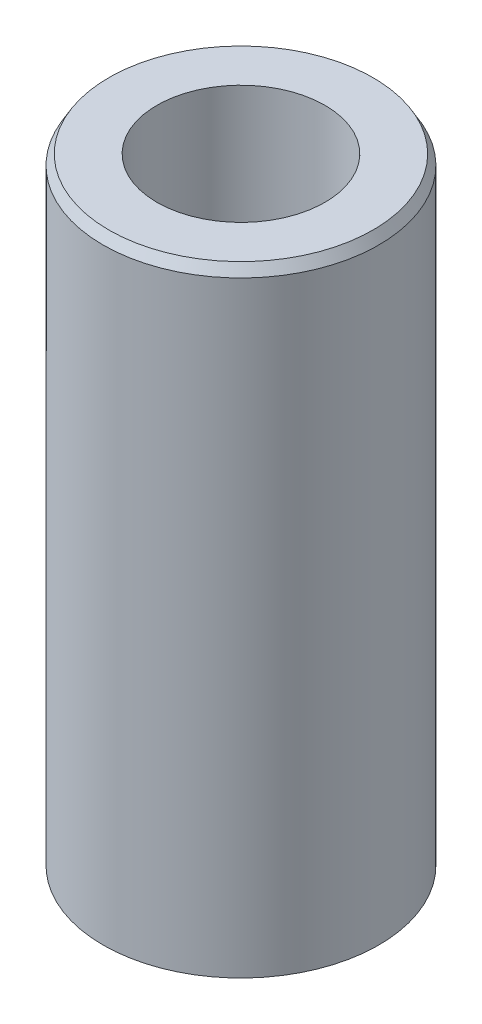
ISO-10303-21;
HEADER;
FILE_DESCRIPTION(('STEP AP214'),'2;1');
FILE_NAME('part.step','',(''),(''),'','','');
FILE_SCHEMA(('AUTOMOTIVE_DESIGN { 1 0 10303 214 1 1 1 1 }'));
ENDSEC;
DATA;
#1=APPLICATION_CONTEXT('core data for automotive mechanical design processes');
#2=APPLICATION_PROTOCOL_DEFINITION('international standard','automotive_design',2000,#1);
#3=PRODUCT_CONTEXT('',#1,'mechanical');
#4=PRODUCT('Part','Part','',(#3));
#5=PRODUCT_RELATED_PRODUCT_CATEGORY('part','',(#4));
#6=PRODUCT_DEFINITION_FORMATION('','',#4);
#7=PRODUCT_DEFINITION_CONTEXT('part definition',#1,'design');
#8=PRODUCT_DEFINITION('design','',#6,#7);
#9=PRODUCT_DEFINITION_SHAPE('','',#8);
#10=(LENGTH_UNIT() NAMED_UNIT(*) SI_UNIT(.MILLI.,.METRE.));
#11=(NAMED_UNIT(*) PLANE_ANGLE_UNIT() SI_UNIT($,.RADIAN.));
#12=(NAMED_UNIT(*) SI_UNIT($,.STERADIAN.) SOLID_ANGLE_UNIT());
#13=UNCERTAINTY_MEASURE_WITH_UNIT(LENGTH_MEASURE(1.E-05),#10,'distance_accuracy_value','');
#14=(GEOMETRIC_REPRESENTATION_CONTEXT(3) GLOBAL_UNCERTAINTY_ASSIGNED_CONTEXT((#13)) GLOBAL_UNIT_ASSIGNED_CONTEXT((#10,
#11,#12)) REPRESENTATION_CONTEXT('',''));
#15=CARTESIAN_POINT('',(0.,0.,0.));
#16=DIRECTION('',(0.,0.,1.));
#17=DIRECTION('',(1.,0.,0.));
#18=AXIS2_PLACEMENT_3D('',#15,#16,#17);
#19=CARTESIAN_POINT('',(0.,259.494421782768,0.));
#20=DIRECTION('',(0.,-1.,0.));
#21=DIRECTION('',(0.,0.,-1.));
#22=AXIS2_PLACEMENT_3D('',#19,#20,#21);
#23=CYLINDRICAL_SURFACE('',#22,57.5);
#24=CARTESIAN_POINT('',(0.,255.298079394231,0.));
#25=DIRECTION('',(0.,1.,0.));
#26=DIRECTION('',(0.,0.,1.));
#27=AXIS2_PLACEMENT_3D('',#24,#25,#26);
#28=CIRCLE('',#27,57.5);
#29=CARTESIAN_POINT('',(0.,255.298079394231,57.5));
#30=VERTEX_POINT('',#29);
#31=EDGE_CURVE('E50',#30,#30,#28,.F.);
#32=ORIENTED_EDGE('',*,*,#31,.T.);
#33=EDGE_LOOP('',(#32));
#34=FACE_BOUND('',#33,.T.);
#35=CARTESIAN_POINT('',(0.,2.42275940763359,0.));
#36=DIRECTION('',(0.,1.,0.));
#37=DIRECTION('',(0.,0.,1.));
#38=AXIS2_PLACEMENT_3D('',#35,#36,#37);
#39=CIRCLE('',#38,57.5);
#40=CARTESIAN_POINT('',(0.,2.42275940763359,57.5));
#41=VERTEX_POINT('',#40);
#42=EDGE_CURVE('E51',#41,#41,#39,.T.);
#43=ORIENTED_EDGE('',*,*,#42,.T.);
#44=EDGE_LOOP('',(#43));
#45=FACE_BOUND('',#44,.T.);
#46=ADVANCED_FACE('F39',(#34,#45),#23,.T.);
#47=CARTESIAN_POINT('',(0.,259.494421782768,0.));
#48=DIRECTION('',(0.,1.,0.));
#49=DIRECTION('',(0.,0.,1.));
#50=AXIS2_PLACEMENT_3D('',#47,#48,#49);
#51=PLANE('',#50);
#52=CARTESIAN_POINT('',(0.,259.494421782768,0.));
#53=DIRECTION('',(0.,1.,0.));
#54=DIRECTION('',(0.,0.,1.));
#55=AXIS2_PLACEMENT_3D('',#52,#53,#54);
#56=CIRCLE('',#55,55.0772405923664);
#57=CARTESIAN_POINT('',(0.,259.494421782768,55.0772405923664));
#58=VERTEX_POINT('',#57);
#59=EDGE_CURVE('E54',#58,#58,#56,.T.);
#60=ORIENTED_EDGE('',*,*,#59,.T.);
#61=EDGE_LOOP('',(#60));
#62=FACE_BOUND('',#61,.T.);
#63=CARTESIAN_POINT('',(0.,259.494421782768,0.));
#64=DIRECTION('',(0.,1.,0.));
#65=DIRECTION('',(0.,0.,1.));
#66=AXIS2_PLACEMENT_3D('',#63,#64,#65);
#67=CIRCLE('',#66,35.0617956177539);
#68=CARTESIAN_POINT('',(0.,259.494421782768,35.0617956177539));
#69=VERTEX_POINT('',#68);
#70=EDGE_CURVE('E58',#69,#69,#67,.T.);
#71=ORIENTED_EDGE('',*,*,#70,.F.);
#72=EDGE_LOOP('',(#71));
#73=FACE_BOUND('',#72,.T.);
#74=ADVANCED_FACE('F69',(#62,#73),#51,.T.);
#75=CARTESIAN_POINT('',(0.,0.,0.));
#76=DIRECTION('',(0.,1.,0.));
#77=DIRECTION('',(0.,0.,1.));
#78=AXIS2_PLACEMENT_3D('',#75,#76,#77);
#79=PLANE('',#78);
#80=CARTESIAN_POINT('',(0.,0.,0.));
#81=DIRECTION('',(0.,1.,0.));
#82=DIRECTION('',(0.,0.,1.));
#83=AXIS2_PLACEMENT_3D('',#80,#81,#82);
#84=CIRCLE('',#83,53.3036576114631);
#85=CARTESIAN_POINT('',(0.,0.,53.3036576114631));
#86=VERTEX_POINT('',#85);
#87=EDGE_CURVE('E10',#86,#86,#84,.F.);
#88=ORIENTED_EDGE('',*,*,#87,.T.);
#89=EDGE_LOOP('',(#88));
#90=FACE_BOUND('',#89,.T.);
#91=CARTESIAN_POINT('',(0.,0.,0.));
#92=DIRECTION('',(0.,1.,0.));
#93=DIRECTION('',(0.,0.,1.));
#94=AXIS2_PLACEMENT_3D('',#91,#92,#93);
#95=CIRCLE('',#94,35.0617956177539);
#96=CARTESIAN_POINT('',(0.,0.,35.0617956177539));
#97=VERTEX_POINT('',#96);
#98=EDGE_CURVE('E63',#97,#97,#95,.T.);
#99=ORIENTED_EDGE('',*,*,#98,.T.);
#100=EDGE_LOOP('',(#99));
#101=FACE_BOUND('',#100,.T.);
#102=ADVANCED_FACE('F75',(#90,#101),#79,.F.);
#103=CARTESIAN_POINT('',(0.,259.494421782768,0.));
#104=DIRECTION('',(0.,-1.,0.));
#105=DIRECTION('',(0.,0.,-1.));
#106=AXIS2_PLACEMENT_3D('',#103,#104,#105);
#107=CYLINDRICAL_SURFACE('',#106,35.0617956177539);
#108=ORIENTED_EDGE('',*,*,#70,.T.);
#109=EDGE_LOOP('',(#108));
#110=FACE_BOUND('',#109,.T.);
#111=ORIENTED_EDGE('',*,*,#98,.F.);
#112=EDGE_LOOP('',(#111));
#113=FACE_BOUND('',#112,.T.);
#114=ADVANCED_FACE('F70',(#110,#113),#107,.F.);
#115=CARTESIAN_POINT('',(0.,259.494421782768,0.));
#116=DIRECTION('',(0.,-1.,0.));
#117=DIRECTION('',(0.,0.,-1.));
#118=AXIS2_PLACEMENT_3D('',#115,#116,#117);
#119=CONICAL_SURFACE('',#118,55.0772405923664,0.523598775598296);
#120=ORIENTED_EDGE('',*,*,#31,.F.);
#121=EDGE_LOOP('',(#120));
#122=FACE_BOUND('',#121,.T.);
#123=ORIENTED_EDGE('',*,*,#59,.F.);
#124=EDGE_LOOP('',(#123));
#125=FACE_BOUND('',#124,.T.);
#126=ADVANCED_FACE('F81',(#122,#125),#119,.T.);
#127=CARTESIAN_POINT('',(0.,2.42275940763359,0.));
#128=DIRECTION('',(0.,1.,0.));
#129=DIRECTION('',(0.,0.,1.));
#130=AXIS2_PLACEMENT_3D('',#127,#128,#129);
#131=CONICAL_SURFACE('',#130,57.5,1.04719755119661);
#132=CARTESIAN_POINT('',(0.,0.,53.3036576114631));
#133=CARTESIAN_POINT('',(0.,0.0252370771628502,53.3473695113437));
#134=CARTESIAN_POINT('',(0.,0.0504741543256997,53.3910814112243));
#135=CARTESIAN_POINT('',(0.,0.100948308651399,53.4785052109854));
#136=CARTESIAN_POINT('',(0.,0.126185385814248,53.522217110866));
#137=CARTESIAN_POINT('',(0.,0.176659540139949,53.6096409106272));
#138=CARTESIAN_POINT('',(0.,0.201896617302799,53.6533528105078));
#139=CARTESIAN_POINT('',(0.,0.252370771628499,53.740776610269));
#140=CARTESIAN_POINT('',(0.,0.277607848791349,53.7844885101496));
#141=CARTESIAN_POINT('',(0.,0.328082003117048,53.8719123099108));
#142=CARTESIAN_POINT('',(0.,0.353319080279898,53.9156242097914));
#143=CARTESIAN_POINT('',(0.,0.403793234605598,54.0030480095526));
#144=CARTESIAN_POINT('',(0.,0.429030311768448,54.0467599094331));
#145=CARTESIAN_POINT('',(0.,0.479504466094148,54.1341837091943));
#146=CARTESIAN_POINT('',(0.,0.504741543256997,54.1778956090749));
#147=CARTESIAN_POINT('',(0.,0.555215697582697,54.2653194088361));
#148=CARTESIAN_POINT('',(0.,0.580452774745547,54.3090313087167));
#149=CARTESIAN_POINT('',(0.,0.630926929071247,54.3964551084779));
#150=CARTESIAN_POINT('',(0.,0.656164006234097,54.4401670083585));
#151=CARTESIAN_POINT('',(0.,0.706638160559796,54.5275908081197));
#152=CARTESIAN_POINT('',(0.,0.731875237722646,54.5713027080003));
#153=CARTESIAN_POINT('',(0.,0.782349392048346,54.6587265077615));
#154=CARTESIAN_POINT('',(0.,0.807586469211196,54.702438407642));
#155=CARTESIAN_POINT('',(0.,0.858060623536896,54.7898622074032));
#156=CARTESIAN_POINT('',(0.,0.883297700699746,54.8335741072838));
#157=CARTESIAN_POINT('',(0.,0.933771855025446,54.920997907045));
#158=CARTESIAN_POINT('',(0.,0.959008932188296,54.9647098069256));
#159=CARTESIAN_POINT('',(0.,1.009483086514,55.0521336066868));
#160=CARTESIAN_POINT('',(0.,1.03472016367685,55.0958455065674));
#161=CARTESIAN_POINT('',(0.,1.08519431800255,55.1832693063286));
#162=CARTESIAN_POINT('',(0.,1.1104313951654,55.2269812062092));
#163=CARTESIAN_POINT('',(0.,1.16090554949109,55.3144050059704));
#164=CARTESIAN_POINT('',(0.,1.18614262665394,55.3581169058509));
#165=CARTESIAN_POINT('',(0.,1.23661678097964,55.4455407056121));
#166=CARTESIAN_POINT('',(0.,1.26185385814249,55.4892526054927));
#167=CARTESIAN_POINT('',(0.,1.31232801246819,55.5766764052539));
#168=CARTESIAN_POINT('',(0.,1.33756508963104,55.6203883051345));
#169=CARTESIAN_POINT('',(0.,1.38803924395674,55.7078121048957));
#170=CARTESIAN_POINT('',(0.,1.41327632111959,55.7515240047763));
#171=CARTESIAN_POINT('',(0.,1.46375047544529,55.8389478045375));
#172=CARTESIAN_POINT('',(0.,1.48898755260814,55.8826597044181));
#173=CARTESIAN_POINT('',(0.,1.53946170693384,55.9700835041793));
#174=CARTESIAN_POINT('',(0.,1.56469878409669,56.0137954040598));
#175=CARTESIAN_POINT('',(0.,1.61517293842239,56.101219203821));
#176=CARTESIAN_POINT('',(0.,1.64041001558524,56.1449311037016));
#177=CARTESIAN_POINT('',(0.,1.69088416991094,56.2323549034628));
#178=CARTESIAN_POINT('',(0.,1.71612124707379,56.2760668033434));
#179=CARTESIAN_POINT('',(0.,1.76659540139949,56.3634906031046));
#180=CARTESIAN_POINT('',(0.,1.79183247856234,56.4072025029852));
#181=CARTESIAN_POINT('',(0.,1.84230663288804,56.4946263027464));
#182=CARTESIAN_POINT('',(0.,1.86754371005089,56.538338202627));
#183=CARTESIAN_POINT('',(0.,1.91801786437659,56.6257620023881));
#184=CARTESIAN_POINT('',(0.,1.94325494153944,56.6694739022687));
#185=CARTESIAN_POINT('',(0.,1.99372909586514,56.7568977020299));
#186=CARTESIAN_POINT('',(0.,2.01896617302799,56.8006096019105));
#187=CARTESIAN_POINT('',(0.,2.06944032735369,56.8880334016717));
#188=CARTESIAN_POINT('',(0.,2.09467740451654,56.9317453015523));
#189=CARTESIAN_POINT('',(0.,2.14515155884224,57.0191691013135));
#190=CARTESIAN_POINT('',(0.,2.17038863600509,57.0628810011941));
#191=CARTESIAN_POINT('',(0.,2.22086279033079,57.1503048009553));
#192=CARTESIAN_POINT('',(0.,2.24609986749364,57.1940167008358));
#193=CARTESIAN_POINT('',(0.,2.29657402181934,57.281440500597));
#194=CARTESIAN_POINT('',(0.,2.32181109898219,57.3251524004776));
#195=CARTESIAN_POINT('',(0.,2.37228525330789,57.4125762002388));
#196=CARTESIAN_POINT('',(0.,2.39752233047074,57.4562881001194));
#197=CARTESIAN_POINT('',(0.,2.42275940763359,57.5));
#198=B_SPLINE_CURVE_WITH_KNOTS('',3,(#132,#133,#134,#135,#136,#137,#138,#139,#140,#141,#142,
#143,#144,#145,#146,#147,#148,#149,#150,#151,#152,#153,#154,#155,#156,#157,#158,#159,#160,#161,
#162,#163,#164,#165,#166,#167,#168,#169,#170,#171,#172,#173,#174,#175,#176,#177,#178,#179,#180,
#181,#182,#183,#184,#185,#186,#187,#188,#189,#190,#191,#192,#193,#194,#195,#196,#197),
.UNSPECIFIED.,.F.,.F.,(4,2,2,2,2,2,2,2,2,2,2,2,2,2,2,2,2,2,2,2,2,2,2,2,2,2,2,2,2,2,2,2,4),(0.,
0.151422462977102,0.302844925954204,0.454267388931299,0.605689851908401,0.757112314885503,
0.908534777862605,1.05995724083971,1.21137970381681,1.36280216679391,1.51422462977101,
1.66564709274811,1.81706955572522,1.96849201870232,2.11991448167942,2.27133694465652,
2.42275940763362,2.57418187061073,2.72560433358783,2.87702679656493,3.02844925954203,
3.17987172251913,3.33129418549623,3.48271664847333,3.63413911145043,3.78556157442754,
3.93698403740464,4.08840650038174,4.23982896335884,4.39125142633594,4.54267388931305,
4.69409635229015,4.84551881526725),.UNSPECIFIED.);
#199=EDGE_CURVE('BSEAM45',#86,#41,#198,.T.);
#200=ORIENTED_EDGE('',*,*,#87,.F.);
#201=ORIENTED_EDGE('',*,*,#42,.F.);
#202=ORIENTED_EDGE('',*,*,#199,.T.);
#203=ORIENTED_EDGE('',*,*,#199,.F.);
#204=EDGE_LOOP('',(#200,#202,#201,#203));
#205=FACE_BOUND('',#204,.T.);
#206=ADVANCED_FACE('F45',(#205),#131,.T.);
#207=CLOSED_SHELL('',(#46,#74,#102,#114,#126,#206));
#208=MANIFOLD_SOLID_BREP('B2',#207);
#209=ADVANCED_BREP_SHAPE_REPRESENTATION('',(#18,#208),#14);
#210=SHAPE_DEFINITION_REPRESENTATION(#9,#209);
ENDSEC;
END-ISO-10303-21;
